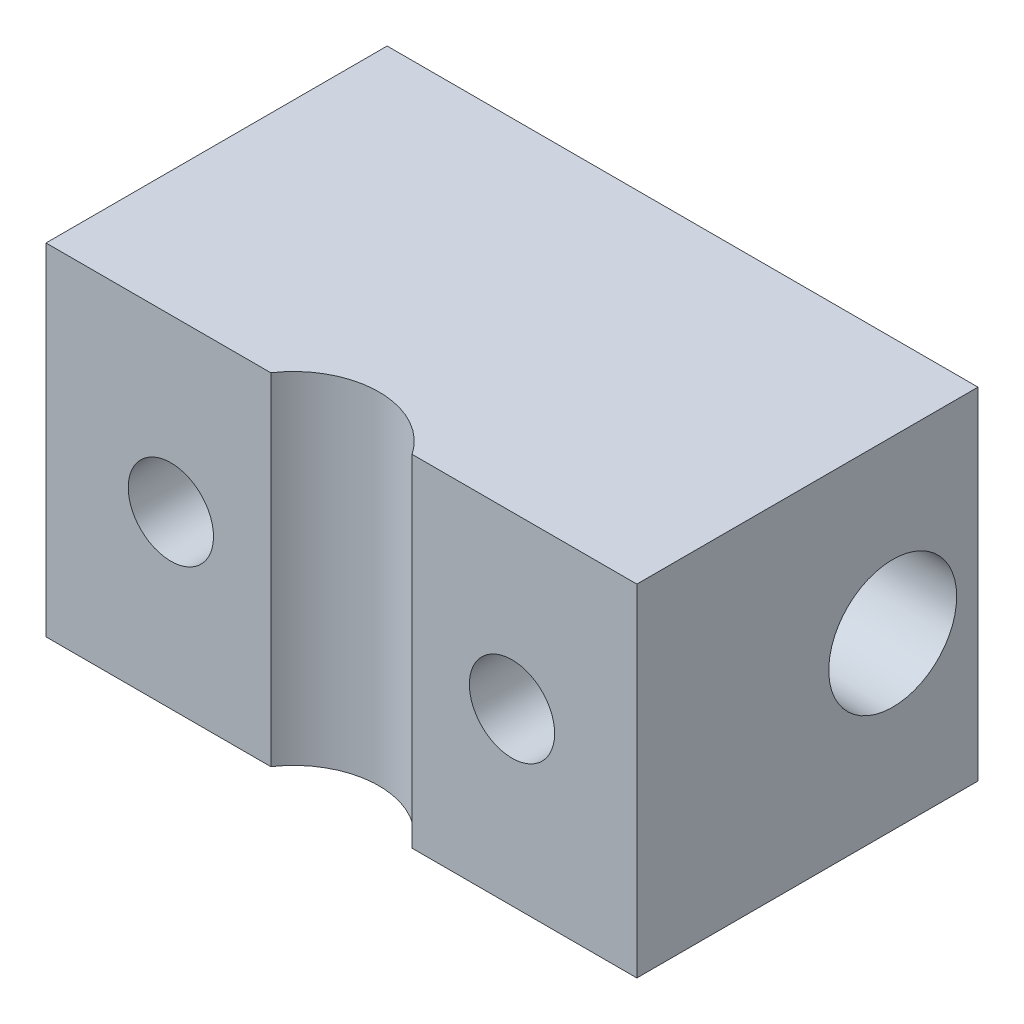
ISO-10303-21;
HEADER;
FILE_DESCRIPTION(('STEP AP214'),'2;1');
FILE_NAME('part.step','',(''),(''),'','','');
FILE_SCHEMA(('AUTOMOTIVE_DESIGN { 1 0 10303 214 1 1 1 1 }'));
ENDSEC;
DATA;
#1=APPLICATION_CONTEXT('core data for automotive mechanical design processes');
#2=APPLICATION_PROTOCOL_DEFINITION('international standard','automotive_design',2000,#1);
#3=PRODUCT_CONTEXT('',#1,'mechanical');
#4=PRODUCT('Part','Part','',(#3));
#5=PRODUCT_RELATED_PRODUCT_CATEGORY('part','',(#4));
#6=PRODUCT_DEFINITION_FORMATION('','',#4);
#7=PRODUCT_DEFINITION_CONTEXT('part definition',#1,'design');
#8=PRODUCT_DEFINITION('design','',#6,#7);
#9=PRODUCT_DEFINITION_SHAPE('','',#8);
#10=(LENGTH_UNIT() NAMED_UNIT(*) SI_UNIT(.MILLI.,.METRE.));
#11=(NAMED_UNIT(*) PLANE_ANGLE_UNIT() SI_UNIT($,.RADIAN.));
#12=(NAMED_UNIT(*) SI_UNIT($,.STERADIAN.) SOLID_ANGLE_UNIT());
#13=UNCERTAINTY_MEASURE_WITH_UNIT(LENGTH_MEASURE(1.E-05),#10,'distance_accuracy_value','');
#14=(GEOMETRIC_REPRESENTATION_CONTEXT(3) GLOBAL_UNCERTAINTY_ASSIGNED_CONTEXT((#13)) GLOBAL_UNIT_ASSIGNED_CONTEXT((#10,
#11,#12)) REPRESENTATION_CONTEXT('',''));
#15=CARTESIAN_POINT('',(0.,0.,0.));
#16=DIRECTION('',(0.,0.,1.));
#17=DIRECTION('',(1.,0.,0.));
#18=AXIS2_PLACEMENT_3D('',#15,#16,#17);
#19=CARTESIAN_POINT('',(0.,6.35,0.));
#20=DIRECTION('',(1.,0.,0.));
#21=DIRECTION('',(0.,0.,-1.));
#22=AXIS2_PLACEMENT_3D('',#19,#20,#21);
#23=PLANE('',#22);
#24=CARTESIAN_POINT('',(0.,3.175,-4.7625));
#25=DIRECTION('',(1.,0.,0.));
#26=DIRECTION('',(0.,0.,-1.));
#27=AXIS2_PLACEMENT_3D('',#24,#25,#26);
#28=CIRCLE('',#27,1.190625);
#29=CARTESIAN_POINT('',(0.,3.175,-5.953125));
#30=VERTEX_POINT('',#29);
#31=EDGE_CURVE('E185',#30,#30,#28,.T.);
#32=ORIENTED_EDGE('',*,*,#31,.T.);
#33=EDGE_LOOP('',(#32));
#34=FACE_BOUND('',#33,.T.);
#35=DIRECTION('',(0.,0.,1.));
#36=VECTOR('',#35,1.);
#37=CARTESIAN_POINT('',(0.,0.,0.));
#38=LINE('',#37,#36);
#39=CARTESIAN_POINT('',(0.,0.,-6.35));
#40=VERTEX_POINT('',#39);
#41=CARTESIAN_POINT('',(0.,0.,0.));
#42=VERTEX_POINT('',#41);
#43=EDGE_CURVE('E131',#40,#42,#38,.T.);
#44=ORIENTED_EDGE('',*,*,#43,.T.);
#45=DIRECTION('',(0.,-1.,0.));
#46=VECTOR('',#45,1.);
#47=CARTESIAN_POINT('',(0.,6.35,0.));
#48=LINE('',#47,#46);
#49=CARTESIAN_POINT('',(0.,6.35,0.));
#50=VERTEX_POINT('',#49);
#51=EDGE_CURVE('E11',#50,#42,#48,.T.);
#52=ORIENTED_EDGE('',*,*,#51,.F.);
#53=DIRECTION('',(0.,0.,1.));
#54=VECTOR('',#53,1.);
#55=CARTESIAN_POINT('',(0.,6.35,0.));
#56=LINE('',#55,#54);
#57=CARTESIAN_POINT('',(0.,6.35,-6.35));
#58=VERTEX_POINT('',#57);
#59=EDGE_CURVE('E148',#58,#50,#56,.T.);
#60=ORIENTED_EDGE('',*,*,#59,.F.);
#61=DIRECTION('',(0.,-1.,0.));
#62=VECTOR('',#61,1.);
#63=CARTESIAN_POINT('',(0.,6.35,-6.35));
#64=LINE('',#63,#62);
#65=EDGE_CURVE('E127',#58,#40,#64,.T.);
#66=ORIENTED_EDGE('',*,*,#65,.T.);
#67=EDGE_LOOP('',(#44,#52,#60,#66));
#68=FACE_BOUND('',#67,.T.);
#69=ADVANCED_FACE('F39',(#34,#68),#23,.F.);
#70=CARTESIAN_POINT('',(0.,6.35,0.));
#71=DIRECTION('',(0.,0.,-1.));
#72=DIRECTION('',(-1.,0.,0.));
#73=AXIS2_PLACEMENT_3D('',#70,#71,#72);
#74=PLANE('',#73);
#75=CARTESIAN_POINT('',(2.3241,3.175,0.));
#76=DIRECTION('',(0.,0.,1.));
#77=DIRECTION('',(1.,0.,0.));
#78=AXIS2_PLACEMENT_3D('',#75,#76,#77);
#79=CIRCLE('',#78,0.793749999999989);
#80=CARTESIAN_POINT('',(3.11784999999999,3.175,0.));
#81=VERTEX_POINT('',#80);
#82=EDGE_CURVE('E188',#81,#81,#79,.T.);
#83=ORIENTED_EDGE('',*,*,#82,.F.);
#84=EDGE_LOOP('',(#83));
#85=FACE_BOUND('',#84,.T.);
#86=DIRECTION('',(1.,0.,0.));
#87=VECTOR('',#86,1.);
#88=CARTESIAN_POINT('',(0.,0.,0.));
#89=LINE('',#88,#87);
#90=CARTESIAN_POINT('',(4.18386798624729,0.,0.));
#91=VERTEX_POINT('',#90);
#92=EDGE_CURVE('E135',#42,#91,#89,.T.);
#93=ORIENTED_EDGE('',*,*,#92,.T.);
#94=DIRECTION('',(0.,-1.,0.));
#95=VECTOR('',#94,1.);
#96=CARTESIAN_POINT('',(4.18386798624729,6.35,0.));
#97=LINE('',#96,#95);
#98=CARTESIAN_POINT('',(4.18386798624729,6.35,0.));
#99=VERTEX_POINT('',#98);
#100=EDGE_CURVE('E48',#99,#91,#97,.T.);
#101=ORIENTED_EDGE('',*,*,#100,.F.);
#102=DIRECTION('',(1.,0.,0.));
#103=VECTOR('',#102,1.);
#104=CARTESIAN_POINT('',(0.,6.35,0.));
#105=LINE('',#104,#103);
#106=EDGE_CURVE('E94',#50,#99,#105,.T.);
#107=ORIENTED_EDGE('',*,*,#106,.F.);
#108=ORIENTED_EDGE('',*,*,#51,.T.);
#109=EDGE_LOOP('',(#93,#101,#107,#108));
#110=FACE_BOUND('',#109,.T.);
#111=ADVANCED_FACE('F177',(#85,#110),#74,.F.);
#112=CARTESIAN_POINT('',(5.4991,6.35,0.889));
#113=DIRECTION('',(0.,-1.,0.));
#114=DIRECTION('',(0.,0.,-1.));
#115=AXIS2_PLACEMENT_3D('',#112,#113,#114);
#116=CYLINDRICAL_SURFACE('',#115,1.5875);
#117=CARTESIAN_POINT('',(5.4991,0.,0.889));
#118=DIRECTION('',(0.,-1.,0.));
#119=DIRECTION('',(0.,0.,1.));
#120=AXIS2_PLACEMENT_3D('',#117,#118,#119);
#121=CIRCLE('',#120,1.5875);
#122=CARTESIAN_POINT('',(6.81433201375271,0.,0.));
#123=VERTEX_POINT('',#122);
#124=EDGE_CURVE('E139',#91,#123,#121,.T.);
#125=ORIENTED_EDGE('',*,*,#124,.T.);
#126=DIRECTION('',(0.,-1.,0.));
#127=VECTOR('',#126,1.);
#128=CARTESIAN_POINT('',(6.81433201375271,6.35,0.));
#129=LINE('',#128,#127);
#130=CARTESIAN_POINT('',(6.81433201375271,6.35,0.));
#131=VERTEX_POINT('',#130);
#132=EDGE_CURVE('E120',#131,#123,#129,.T.);
#133=ORIENTED_EDGE('',*,*,#132,.F.);
#134=CARTESIAN_POINT('',(5.4991,6.35,0.889));
#135=DIRECTION('',(0.,-1.,0.));
#136=DIRECTION('',(0.,0.,1.));
#137=AXIS2_PLACEMENT_3D('',#134,#135,#136);
#138=CIRCLE('',#137,1.5875);
#139=EDGE_CURVE('E109',#99,#131,#138,.T.);
#140=ORIENTED_EDGE('',*,*,#139,.F.);
#141=ORIENTED_EDGE('',*,*,#100,.T.);
#142=EDGE_LOOP('',(#125,#133,#140,#141));
#143=FACE_BOUND('',#142,.T.);
#144=ADVANCED_FACE('F158',(#143),#116,.F.);
#145=CARTESIAN_POINT('',(6.81433201375271,6.35,0.));
#146=DIRECTION('',(0.,0.,-1.));
#147=DIRECTION('',(-1.,0.,0.));
#148=AXIS2_PLACEMENT_3D('',#145,#146,#147);
#149=PLANE('',#148);
#150=CARTESIAN_POINT('',(8.6741,3.175,0.));
#151=DIRECTION('',(0.,0.,1.));
#152=DIRECTION('',(1.,0.,0.));
#153=AXIS2_PLACEMENT_3D('',#150,#151,#152);
#154=CIRCLE('',#153,0.793749999999989);
#155=CARTESIAN_POINT('',(9.46784999999999,3.175,0.));
#156=VERTEX_POINT('',#155);
#157=EDGE_CURVE('E202',#156,#156,#154,.T.);
#158=ORIENTED_EDGE('',*,*,#157,.F.);
#159=EDGE_LOOP('',(#158));
#160=FACE_BOUND('',#159,.T.);
#161=DIRECTION('',(1.,0.,0.));
#162=VECTOR('',#161,1.);
#163=CARTESIAN_POINT('',(6.81433201375271,0.,0.));
#164=LINE('',#163,#162);
#165=CARTESIAN_POINT('',(10.9982,0.,0.));
#166=VERTEX_POINT('',#165);
#167=EDGE_CURVE('E118',#123,#166,#164,.T.);
#168=ORIENTED_EDGE('',*,*,#167,.T.);
#169=DIRECTION('',(0.,-1.,0.));
#170=VECTOR('',#169,1.);
#171=CARTESIAN_POINT('',(10.9982,6.35,0.));
#172=LINE('',#171,#170);
#173=CARTESIAN_POINT('',(10.9982,6.35,0.));
#174=VERTEX_POINT('',#173);
#175=EDGE_CURVE('E115',#174,#166,#172,.T.);
#176=ORIENTED_EDGE('',*,*,#175,.F.);
#177=DIRECTION('',(1.,0.,0.));
#178=VECTOR('',#177,1.);
#179=CARTESIAN_POINT('',(6.81433201375271,6.35,0.));
#180=LINE('',#179,#178);
#181=EDGE_CURVE('E103',#131,#174,#180,.T.);
#182=ORIENTED_EDGE('',*,*,#181,.F.);
#183=ORIENTED_EDGE('',*,*,#132,.T.);
#184=EDGE_LOOP('',(#168,#176,#182,#183));
#185=FACE_BOUND('',#184,.T.);
#186=ADVANCED_FACE('F116',(#160,#185),#149,.F.);
#187=CARTESIAN_POINT('',(10.9982,6.35,0.));
#188=DIRECTION('',(-1.,0.,0.));
#189=DIRECTION('',(0.,0.,1.));
#190=AXIS2_PLACEMENT_3D('',#187,#188,#189);
#191=PLANE('',#190);
#192=CARTESIAN_POINT('',(10.9982,3.175,-4.7625));
#193=DIRECTION('',(1.,0.,0.));
#194=DIRECTION('',(0.,0.,-1.));
#195=AXIS2_PLACEMENT_3D('',#192,#193,#194);
#196=CIRCLE('',#195,1.19062499999999);
#197=CARTESIAN_POINT('',(10.9982,3.175,-5.95312499999999));
#198=VERTEX_POINT('',#197);
#199=EDGE_CURVE('E189',#198,#198,#196,.T.);
#200=ORIENTED_EDGE('',*,*,#199,.F.);
#201=EDGE_LOOP('',(#200));
#202=FACE_BOUND('',#201,.T.);
#203=DIRECTION('',(0.,0.,-1.));
#204=VECTOR('',#203,1.);
#205=CARTESIAN_POINT('',(10.9982,0.,0.));
#206=LINE('',#205,#204);
#207=CARTESIAN_POINT('',(10.9982,0.,-6.35));
#208=VERTEX_POINT('',#207);
#209=EDGE_CURVE('E80',#166,#208,#206,.T.);
#210=ORIENTED_EDGE('',*,*,#209,.T.);
#211=DIRECTION('',(0.,-1.,0.));
#212=VECTOR('',#211,1.);
#213=CARTESIAN_POINT('',(10.9982,6.35,-6.35));
#214=LINE('',#213,#212);
#215=CARTESIAN_POINT('',(10.9982,6.35,-6.35));
#216=VERTEX_POINT('',#215);
#217=EDGE_CURVE('E121',#216,#208,#214,.T.);
#218=ORIENTED_EDGE('',*,*,#217,.F.);
#219=DIRECTION('',(0.,0.,-1.));
#220=VECTOR('',#219,1.);
#221=CARTESIAN_POINT('',(10.9982,6.35,0.));
#222=LINE('',#221,#220);
#223=EDGE_CURVE('E107',#174,#216,#222,.T.);
#224=ORIENTED_EDGE('',*,*,#223,.F.);
#225=ORIENTED_EDGE('',*,*,#175,.T.);
#226=EDGE_LOOP('',(#210,#218,#224,#225));
#227=FACE_BOUND('',#226,.T.);
#228=ADVANCED_FACE('F123',(#202,#227),#191,.F.);
#229=CARTESIAN_POINT('',(0.,6.35,-6.35));
#230=DIRECTION('',(0.,0.,1.));
#231=DIRECTION('',(1.,0.,0.));
#232=AXIS2_PLACEMENT_3D('',#229,#230,#231);
#233=PLANE('',#232);
#234=DIRECTION('',(-1.,0.,0.));
#235=VECTOR('',#234,1.);
#236=CARTESIAN_POINT('',(0.,0.,-6.35));
#237=LINE('',#236,#235);
#238=EDGE_CURVE('E86',#208,#40,#237,.T.);
#239=ORIENTED_EDGE('',*,*,#238,.T.);
#240=ORIENTED_EDGE('',*,*,#65,.F.);
#241=DIRECTION('',(-1.,0.,0.));
#242=VECTOR('',#241,1.);
#243=CARTESIAN_POINT('',(0.,6.35,-6.35));
#244=LINE('',#243,#242);
#245=EDGE_CURVE('E56',#216,#58,#244,.T.);
#246=ORIENTED_EDGE('',*,*,#245,.F.);
#247=ORIENTED_EDGE('',*,*,#217,.T.);
#248=EDGE_LOOP('',(#239,#240,#246,#247));
#249=FACE_BOUND('',#248,.T.);
#250=ADVANCED_FACE('F165',(#249),#233,.F.);
#251=CARTESIAN_POINT('',(5.4991,6.35,0.889));
#252=DIRECTION('',(0.,1.,0.));
#253=DIRECTION('',(0.,0.,1.));
#254=AXIS2_PLACEMENT_3D('',#251,#252,#253);
#255=PLANE('',#254);
#256=ORIENTED_EDGE('',*,*,#59,.T.);
#257=ORIENTED_EDGE('',*,*,#106,.T.);
#258=ORIENTED_EDGE('',*,*,#139,.T.);
#259=ORIENTED_EDGE('',*,*,#181,.T.);
#260=ORIENTED_EDGE('',*,*,#223,.T.);
#261=ORIENTED_EDGE('',*,*,#245,.T.);
#262=EDGE_LOOP('',(#256,#257,#258,#259,#260,#261));
#263=FACE_BOUND('',#262,.T.);
#264=ADVANCED_FACE('F105',(#263),#255,.T.);
#265=CARTESIAN_POINT('',(5.4991,0.,0.889));
#266=DIRECTION('',(0.,1.,0.));
#267=DIRECTION('',(0.,0.,1.));
#268=AXIS2_PLACEMENT_3D('',#265,#266,#267);
#269=PLANE('',#268);
#270=ORIENTED_EDGE('',*,*,#43,.F.);
#271=ORIENTED_EDGE('',*,*,#238,.F.);
#272=ORIENTED_EDGE('',*,*,#209,.F.);
#273=ORIENTED_EDGE('',*,*,#167,.F.);
#274=ORIENTED_EDGE('',*,*,#124,.F.);
#275=ORIENTED_EDGE('',*,*,#92,.F.);
#276=EDGE_LOOP('',(#270,#271,#272,#273,#274,#275));
#277=FACE_BOUND('',#276,.T.);
#278=ADVANCED_FACE('F161',(#277),#269,.F.);
#279=CARTESIAN_POINT('',(8.6741,3.175,-1.5875));
#280=DIRECTION('',(0.,0.,1.));
#281=DIRECTION('',(1.,0.,0.));
#282=AXIS2_PLACEMENT_3D('',#279,#280,#281);
#283=CONICAL_SURFACE('',#282,0.793749999999999,1.02974425867665);
#284=CARTESIAN_POINT('',(8.6741,3.175,-2.06443311635313));
#285=VERTEX_POINT('',#284);
#286=VERTEX_LOOP('',#285);
#287=FACE_BOUND('',#286,.T.);
#288=CARTESIAN_POINT('',(8.6741,3.175,-1.5875));
#289=DIRECTION('',(0.,0.,1.));
#290=DIRECTION('',(1.,0.,0.));
#291=AXIS2_PLACEMENT_3D('',#288,#289,#290);
#292=CIRCLE('',#291,0.793749999999999);
#293=CARTESIAN_POINT('',(9.46785,3.175,-1.5875));
#294=VERTEX_POINT('',#293);
#295=EDGE_CURVE('E136',#294,#294,#292,.T.);
#296=ORIENTED_EDGE('',*,*,#295,.T.);
#297=EDGE_LOOP('',(#296));
#298=FACE_BOUND('',#297,.T.);
#299=ADVANCED_FACE('F215',(#287,#298),#283,.F.);
#300=CARTESIAN_POINT('',(8.6741,3.175,0.));
#301=DIRECTION('',(0.,0.,1.));
#302=DIRECTION('',(1.,0.,0.));
#303=AXIS2_PLACEMENT_3D('',#300,#301,#302);
#304=CYLINDRICAL_SURFACE('',#303,0.793749999999994);
#305=ORIENTED_EDGE('',*,*,#295,.F.);
#306=EDGE_LOOP('',(#305));
#307=FACE_BOUND('',#306,.T.);
#308=ORIENTED_EDGE('',*,*,#157,.T.);
#309=EDGE_LOOP('',(#308));
#310=FACE_BOUND('',#309,.T.);
#311=ADVANCED_FACE('F217',(#307,#310),#304,.F.);
#312=CARTESIAN_POINT('',(2.3241,3.175,-1.5875));
#313=DIRECTION('',(0.,0.,1.));
#314=DIRECTION('',(1.,0.,0.));
#315=AXIS2_PLACEMENT_3D('',#312,#313,#314);
#316=CONICAL_SURFACE('',#315,0.793749999999999,1.02974425867665);
#317=CARTESIAN_POINT('',(2.3241,3.175,-2.06443311635313));
#318=VERTEX_POINT('',#317);
#319=VERTEX_LOOP('',#318);
#320=FACE_BOUND('',#319,.T.);
#321=CARTESIAN_POINT('',(2.3241,3.175,-1.5875));
#322=DIRECTION('',(0.,0.,1.));
#323=DIRECTION('',(1.,0.,0.));
#324=AXIS2_PLACEMENT_3D('',#321,#322,#323);
#325=CIRCLE('',#324,0.793749999999999);
#326=CARTESIAN_POINT('',(3.11785,3.175,-1.5875));
#327=VERTEX_POINT('',#326);
#328=EDGE_CURVE('E194',#327,#327,#325,.T.);
#329=ORIENTED_EDGE('',*,*,#328,.T.);
#330=EDGE_LOOP('',(#329));
#331=FACE_BOUND('',#330,.T.);
#332=ADVANCED_FACE('F220',(#320,#331),#316,.F.);
#333=CARTESIAN_POINT('',(2.3241,3.175,0.));
#334=DIRECTION('',(0.,0.,1.));
#335=DIRECTION('',(1.,0.,0.));
#336=AXIS2_PLACEMENT_3D('',#333,#334,#335);
#337=CYLINDRICAL_SURFACE('',#336,0.793749999999994);
#338=ORIENTED_EDGE('',*,*,#328,.F.);
#339=EDGE_LOOP('',(#338));
#340=FACE_BOUND('',#339,.T.);
#341=ORIENTED_EDGE('',*,*,#82,.T.);
#342=EDGE_LOOP('',(#341));
#343=FACE_BOUND('',#342,.T.);
#344=ADVANCED_FACE('F271',(#340,#343),#337,.F.);
#345=CARTESIAN_POINT('',(10.9982,3.175,-4.7625));
#346=DIRECTION('',(1.,0.,0.));
#347=DIRECTION('',(0.,0.,-1.));
#348=AXIS2_PLACEMENT_3D('',#345,#346,#347);
#349=CYLINDRICAL_SURFACE('',#348,1.19062499999999);
#350=ORIENTED_EDGE('',*,*,#31,.F.);
#351=EDGE_LOOP('',(#350));
#352=FACE_BOUND('',#351,.T.);
#353=ORIENTED_EDGE('',*,*,#199,.T.);
#354=EDGE_LOOP('',(#353));
#355=FACE_BOUND('',#354,.T.);
#356=ADVANCED_FACE('F280',(#352,#355),#349,.F.);
#357=CLOSED_SHELL('',(#69,#111,#144,#186,#228,#250,#264,#278,#299,#311,#332,#344,#356));
#358=MANIFOLD_SOLID_BREP('B2',#357);
#359=ADVANCED_BREP_SHAPE_REPRESENTATION('',(#18,#358),#14);
#360=SHAPE_DEFINITION_REPRESENTATION(#9,#359);
ENDSEC;
END-ISO-10303-21;
